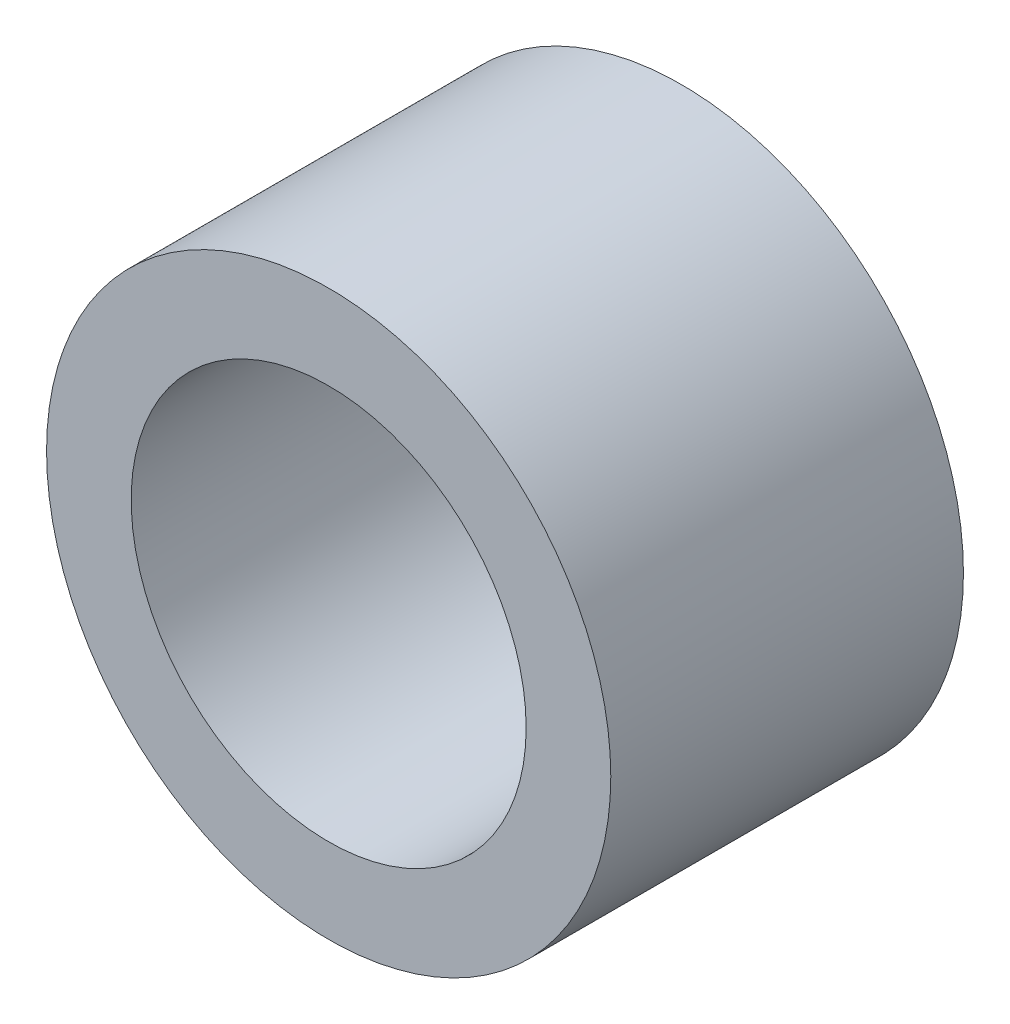
ISO-10303-21;
HEADER;
FILE_DESCRIPTION(('STEP AP214'),'2;1');
FILE_NAME('part.step','',(''),(''),'','','');
FILE_SCHEMA(('AUTOMOTIVE_DESIGN { 1 0 10303 214 1 1 1 1 }'));
ENDSEC;
DATA;
#1=APPLICATION_CONTEXT('core data for automotive mechanical design processes');
#2=APPLICATION_PROTOCOL_DEFINITION('international standard','automotive_design',2000,#1);
#3=PRODUCT_CONTEXT('',#1,'mechanical');
#4=PRODUCT('Part','Part','',(#3));
#5=PRODUCT_RELATED_PRODUCT_CATEGORY('part','',(#4));
#6=PRODUCT_DEFINITION_FORMATION('','',#4);
#7=PRODUCT_DEFINITION_CONTEXT('part definition',#1,'design');
#8=PRODUCT_DEFINITION('design','',#6,#7);
#9=PRODUCT_DEFINITION_SHAPE('','',#8);
#10=(LENGTH_UNIT() NAMED_UNIT(*) SI_UNIT(.MILLI.,.METRE.));
#11=(NAMED_UNIT(*) PLANE_ANGLE_UNIT() SI_UNIT($,.RADIAN.));
#12=(NAMED_UNIT(*) SI_UNIT($,.STERADIAN.) SOLID_ANGLE_UNIT());
#13=UNCERTAINTY_MEASURE_WITH_UNIT(LENGTH_MEASURE(1.E-05),#10,'distance_accuracy_value','');
#14=(GEOMETRIC_REPRESENTATION_CONTEXT(3) GLOBAL_UNCERTAINTY_ASSIGNED_CONTEXT((#13)) GLOBAL_UNIT_ASSIGNED_CONTEXT((#10,
#11,#12)) REPRESENTATION_CONTEXT('',''));
#15=CARTESIAN_POINT('',(0.,0.,0.));
#16=DIRECTION('',(0.,0.,1.));
#17=DIRECTION('',(1.,0.,0.));
#18=AXIS2_PLACEMENT_3D('',#15,#16,#17);
#19=CARTESIAN_POINT('',(0.,0.,10.));
#20=DIRECTION('',(0.,0.,1.));
#21=DIRECTION('',(1.,0.,0.));
#22=AXIS2_PLACEMENT_3D('',#19,#20,#21);
#23=PLANE('',#22);
#24=CARTESIAN_POINT('',(0.,0.,10.));
#25=DIRECTION('',(0.,0.,1.));
#26=DIRECTION('',(1.,0.,0.));
#27=AXIS2_PLACEMENT_3D('',#24,#25,#26);
#28=CIRCLE('',#27,8.);
#29=CARTESIAN_POINT('',(8.,0.,10.));
#30=VERTEX_POINT('',#29);
#31=EDGE_CURVE('E10',#30,#30,#28,.T.);
#32=ORIENTED_EDGE('',*,*,#31,.T.);
#33=EDGE_LOOP('',(#32));
#34=FACE_BOUND('',#33,.T.);
#35=CARTESIAN_POINT('',(0.,0.,10.));
#36=DIRECTION('',(0.,0.,1.));
#37=DIRECTION('',(1.,0.,0.));
#38=AXIS2_PLACEMENT_3D('',#35,#36,#37);
#39=CIRCLE('',#38,5.6);
#40=CARTESIAN_POINT('',(5.6,0.,10.));
#41=VERTEX_POINT('',#40);
#42=EDGE_CURVE('E42',#41,#41,#39,.T.);
#43=ORIENTED_EDGE('',*,*,#42,.F.);
#44=EDGE_LOOP('',(#43));
#45=FACE_BOUND('',#44,.T.);
#46=ADVANCED_FACE('F31',(#34,#45),#23,.T.);
#47=CARTESIAN_POINT('',(0.,0.,0.));
#48=DIRECTION('',(0.,0.,1.));
#49=DIRECTION('',(1.,0.,0.));
#50=AXIS2_PLACEMENT_3D('',#47,#48,#49);
#51=PLANE('',#50);
#52=CARTESIAN_POINT('',(0.,0.,0.));
#53=DIRECTION('',(0.,0.,1.));
#54=DIRECTION('',(1.,0.,0.));
#55=AXIS2_PLACEMENT_3D('',#52,#53,#54);
#56=CIRCLE('',#55,8.);
#57=CARTESIAN_POINT('',(8.,0.,0.));
#58=VERTEX_POINT('',#57);
#59=EDGE_CURVE('E35',#58,#58,#56,.T.);
#60=ORIENTED_EDGE('',*,*,#59,.F.);
#61=EDGE_LOOP('',(#60));
#62=FACE_BOUND('',#61,.T.);
#63=CARTESIAN_POINT('',(0.,0.,0.));
#64=DIRECTION('',(0.,0.,1.));
#65=DIRECTION('',(1.,0.,0.));
#66=AXIS2_PLACEMENT_3D('',#63,#64,#65);
#67=CIRCLE('',#66,5.6);
#68=CARTESIAN_POINT('',(5.6,0.,0.));
#69=VERTEX_POINT('',#68);
#70=EDGE_CURVE('E44',#69,#69,#67,.T.);
#71=ORIENTED_EDGE('',*,*,#70,.T.);
#72=EDGE_LOOP('',(#71));
#73=FACE_BOUND('',#72,.T.);
#74=ADVANCED_FACE('F54',(#62,#73),#51,.F.);
#75=CARTESIAN_POINT('',(0.,0.,10.));
#76=DIRECTION('',(0.,0.,-1.));
#77=DIRECTION('',(-1.,0.,0.));
#78=AXIS2_PLACEMENT_3D('',#75,#76,#77);
#79=CYLINDRICAL_SURFACE('',#78,8.);
#80=ORIENTED_EDGE('',*,*,#31,.F.);
#81=EDGE_LOOP('',(#80));
#82=FACE_BOUND('',#81,.T.);
#83=ORIENTED_EDGE('',*,*,#59,.T.);
#84=EDGE_LOOP('',(#83));
#85=FACE_BOUND('',#84,.T.);
#86=ADVANCED_FACE('F33',(#82,#85),#79,.T.);
#87=CARTESIAN_POINT('',(0.,0.,10.));
#88=DIRECTION('',(0.,0.,-1.));
#89=DIRECTION('',(-1.,0.,0.));
#90=AXIS2_PLACEMENT_3D('',#87,#88,#89);
#91=CYLINDRICAL_SURFACE('',#90,5.6);
#92=ORIENTED_EDGE('',*,*,#42,.T.);
#93=EDGE_LOOP('',(#92));
#94=FACE_BOUND('',#93,.T.);
#95=ORIENTED_EDGE('',*,*,#70,.F.);
#96=EDGE_LOOP('',(#95));
#97=FACE_BOUND('',#96,.T.);
#98=ADVANCED_FACE('F50',(#94,#97),#91,.F.);
#99=CLOSED_SHELL('',(#46,#74,#86,#98));
#100=MANIFOLD_SOLID_BREP('B2',#99);
#101=ADVANCED_BREP_SHAPE_REPRESENTATION('',(#18,#100),#14);
#102=SHAPE_DEFINITION_REPRESENTATION(#9,#101);
ENDSEC;
END-ISO-10303-21;
